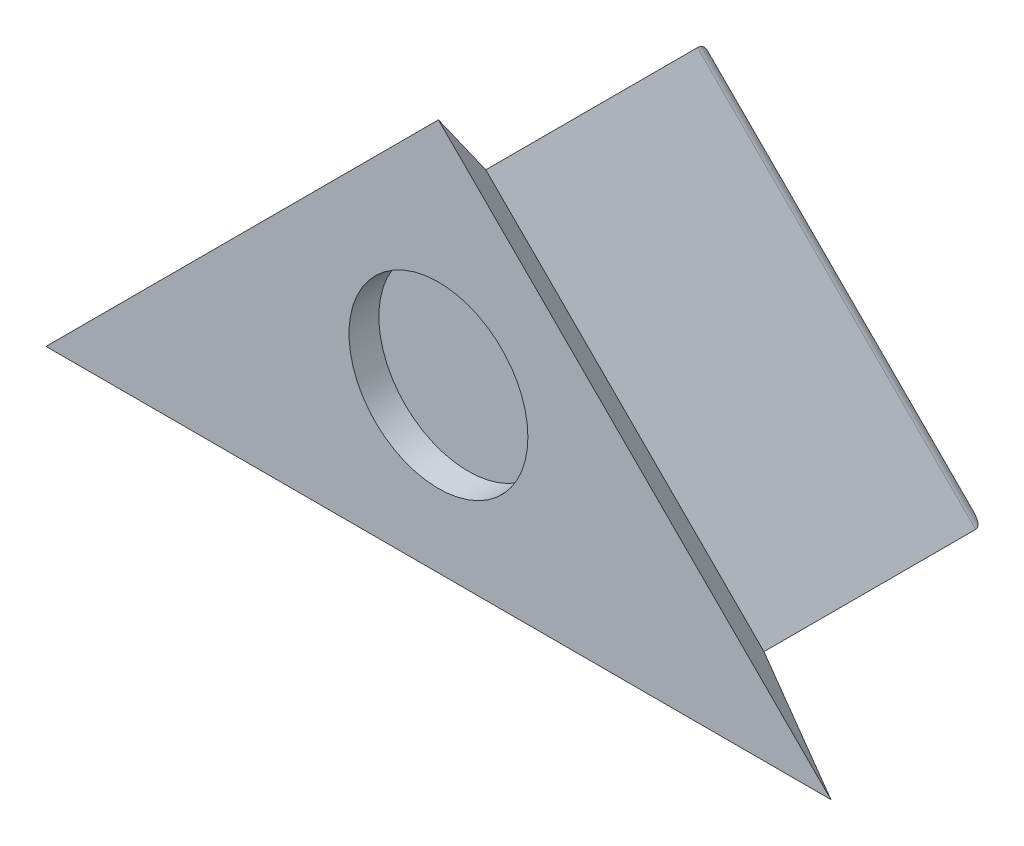
ISO-10303-21;
HEADER;
FILE_DESCRIPTION(('STEP AP214'),'2;1');
FILE_NAME('part.step','',(''),(''),'','','');
FILE_SCHEMA(('AUTOMOTIVE_DESIGN { 1 0 10303 214 1 1 1 1 }'));
ENDSEC;
DATA;
#1=APPLICATION_CONTEXT('core data for automotive mechanical design processes');
#2=APPLICATION_PROTOCOL_DEFINITION('international standard','automotive_design',2000,#1);
#3=PRODUCT_CONTEXT('',#1,'mechanical');
#4=PRODUCT('Part','Part','',(#3));
#5=PRODUCT_RELATED_PRODUCT_CATEGORY('part','',(#4));
#6=PRODUCT_DEFINITION_FORMATION('','',#4);
#7=PRODUCT_DEFINITION_CONTEXT('part definition',#1,'design');
#8=PRODUCT_DEFINITION('design','',#6,#7);
#9=PRODUCT_DEFINITION_SHAPE('','',#8);
#10=(LENGTH_UNIT() NAMED_UNIT(*) SI_UNIT(.MILLI.,.METRE.));
#11=(NAMED_UNIT(*) PLANE_ANGLE_UNIT() SI_UNIT($,.RADIAN.));
#12=(NAMED_UNIT(*) SI_UNIT($,.STERADIAN.) SOLID_ANGLE_UNIT());
#13=UNCERTAINTY_MEASURE_WITH_UNIT(LENGTH_MEASURE(1.E-05),#10,'distance_accuracy_value','');
#14=(GEOMETRIC_REPRESENTATION_CONTEXT(3) GLOBAL_UNCERTAINTY_ASSIGNED_CONTEXT((#13)) GLOBAL_UNIT_ASSIGNED_CONTEXT((#10,
#11,#12)) REPRESENTATION_CONTEXT('',''));
#15=CARTESIAN_POINT('',(0.,0.,0.));
#16=DIRECTION('',(0.,0.,1.));
#17=DIRECTION('',(1.,0.,0.));
#18=AXIS2_PLACEMENT_3D('',#15,#16,#17);
#19=CARTESIAN_POINT('',(-9.33273130117562,-89.9715896423743,-7.5));
#20=DIRECTION('',(0.,-1.,0.));
#21=DIRECTION('',(0.,0.,-1.));
#22=AXIS2_PLACEMENT_3D('',#19,#20,#21);
#23=PLANE('',#22);
#24=DIRECTION('',(0.,0.,1.));
#25=VECTOR('',#24,1.);
#26=CARTESIAN_POINT('',(-9.33273130117562,-89.9715896423743,-7.5));
#27=LINE('',#26,#25);
#28=CARTESIAN_POINT('',(-9.33273130117562,-89.9715896423743,-7.1));
#29=VERTEX_POINT('',#28);
#30=CARTESIAN_POINT('',(-9.3327313011756,-89.9715896423743,0.));
#31=VERTEX_POINT('',#30);
#32=EDGE_CURVE('E133',#29,#31,#27,.T.);
#33=ORIENTED_EDGE('',*,*,#32,.F.);
#34=DIRECTION('',(1.,0.,0.));
#35=VECTOR('',#34,1.);
#36=CARTESIAN_POINT('',(9.33273130117571,-89.9715896423743,-7.1));
#37=LINE('',#36,#35);
#38=CARTESIAN_POINT('',(9.33273130117571,-89.9715896423743,-7.1));
#39=VERTEX_POINT('',#38);
#40=EDGE_CURVE('E12',#29,#39,#37,.T.);
#41=ORIENTED_EDGE('',*,*,#40,.T.);
#42=DIRECTION('',(0.,0.,1.));
#43=VECTOR('',#42,1.);
#44=CARTESIAN_POINT('',(9.33273130117571,-89.9715896423743,-7.5));
#45=LINE('',#44,#43);
#46=CARTESIAN_POINT('',(9.33273130117572,-89.9715896423743,0.));
#47=VERTEX_POINT('',#46);
#48=EDGE_CURVE('E237',#39,#47,#45,.T.);
#49=ORIENTED_EDGE('',*,*,#48,.T.);
#50=DIRECTION('',(1.,0.,0.));
#51=VECTOR('',#50,1.);
#52=CARTESIAN_POINT('',(0.,-89.9715896423743,0.));
#53=LINE('',#52,#51);
#54=EDGE_CURVE('E165',#31,#47,#53,.T.);
#55=ORIENTED_EDGE('',*,*,#54,.F.);
#56=EDGE_LOOP('',(#33,#41,#49,#55));
#57=FACE_BOUND('',#56,.T.);
#58=ADVANCED_FACE('F39',(#57),#23,.T.);
#59=CARTESIAN_POINT('',(1.02673945734377E-13,-80.6388583411986,-7.5));
#60=DIRECTION('',(-0.707106781186546,0.70710678118655,0.));
#61=DIRECTION('',(-0.70710678118655,-0.707106781186546,0.));
#62=AXIS2_PLACEMENT_3D('',#59,#60,#61);
#63=PLANE('',#62);
#64=DIRECTION('',(0.,0.,1.));
#65=VECTOR('',#64,1.);
#66=CARTESIAN_POINT('',(1.02673945734377E-13,-80.6388583411986,-7.5));
#67=LINE('',#66,#65);
#68=CARTESIAN_POINT('',(1.02673945734377E-13,-80.6388583411986,-7.1));
#69=VERTEX_POINT('',#68);
#70=CARTESIAN_POINT('',(1.05873863456701E-13,-80.6388583411986,0.));
#71=VERTEX_POINT('',#70);
#72=EDGE_CURVE('E239',#69,#71,#67,.T.);
#73=ORIENTED_EDGE('',*,*,#72,.F.);
#74=DIRECTION('',(-0.70710678118655,-0.707106781186546,0.));
#75=VECTOR('',#74,1.);
#76=CARTESIAN_POINT('',(-9.33273130117562,-89.9715896423743,-7.1));
#77=LINE('',#76,#75);
#78=EDGE_CURVE('E48',#69,#29,#77,.T.);
#79=ORIENTED_EDGE('',*,*,#78,.T.);
#80=ORIENTED_EDGE('',*,*,#32,.T.);
#81=DIRECTION('',(-0.707106781186548,-0.707106781186546,0.));
#82=VECTOR('',#81,1.);
#83=CARTESIAN_POINT('',(1.04083408558608E-13,-80.6388583411986,0.));
#84=LINE('',#83,#82);
#85=EDGE_CURVE('E119',#71,#31,#84,.T.);
#86=ORIENTED_EDGE('',*,*,#85,.F.);
#87=EDGE_LOOP('',(#73,#79,#80,#86));
#88=FACE_BOUND('',#87,.T.);
#89=ADVANCED_FACE('F243',(#88),#63,.T.);
#90=CARTESIAN_POINT('',(9.33273130117571,-89.9715896423743,-7.5));
#91=DIRECTION('',(0.70710678118655,0.707106781186545,0.));
#92=DIRECTION('',(-0.707106781186545,0.70710678118655,0.));
#93=AXIS2_PLACEMENT_3D('',#90,#91,#92);
#94=PLANE('',#93);
#95=ORIENTED_EDGE('',*,*,#48,.F.);
#96=DIRECTION('',(-0.707106781186545,0.70710678118655,0.));
#97=VECTOR('',#96,1.);
#98=CARTESIAN_POINT('',(0.,-80.6388583411986,-7.1));
#99=LINE('',#98,#97);
#100=EDGE_CURVE('E230',#39,#69,#99,.T.);
#101=ORIENTED_EDGE('',*,*,#100,.T.);
#102=ORIENTED_EDGE('',*,*,#72,.T.);
#103=DIRECTION('',(-0.707106781186545,0.70710678118655,0.));
#104=VECTOR('',#103,1.);
#105=CARTESIAN_POINT('',(9.3327313011757,-89.9715896423743,0.));
#106=LINE('',#105,#104);
#107=EDGE_CURVE('E233',#47,#71,#106,.T.);
#108=ORIENTED_EDGE('',*,*,#107,.F.);
#109=EDGE_LOOP('',(#95,#101,#102,#108));
#110=FACE_BOUND('',#109,.T.);
#111=ADVANCED_FACE('F247',(#110),#94,.T.);
#112=CARTESIAN_POINT('',(0.,0.,-7.5));
#113=DIRECTION('',(0.,0.,1.));
#114=DIRECTION('',(1.,0.,0.));
#115=AXIS2_PLACEMENT_3D('',#112,#113,#114);
#116=PLANE('',#115);
#117=DIRECTION('',(-0.70710678118655,-0.707106781186546,0.));
#118=VECTOR('',#117,1.);
#119=CARTESIAN_POINT('',(0.282842712474724,-80.9217010536732,-7.5));
#120=LINE('',#119,#118);
#121=CARTESIAN_POINT('',(-8.36704587622637,-89.5715896423743,-7.5));
#122=VERTEX_POINT('',#121);
#123=CARTESIAN_POINT('',(1.08742628073339E-13,-81.2045437661479,-7.5));
#124=VERTEX_POINT('',#123);
#125=EDGE_CURVE('E63',#122,#124,#120,.F.);
#126=ORIENTED_EDGE('',*,*,#125,.T.);
#127=DIRECTION('',(-0.707106781186545,0.70710678118655,0.));
#128=VECTOR('',#127,1.);
#129=CARTESIAN_POINT('',(9.04988858870109,-90.2544323548489,-7.5));
#130=LINE('',#129,#128);
#131=CARTESIAN_POINT('',(8.36704587622648,-89.5715896423743,-7.5));
#132=VERTEX_POINT('',#131);
#133=EDGE_CURVE('E225',#124,#132,#130,.F.);
#134=ORIENTED_EDGE('',*,*,#133,.T.);
#135=DIRECTION('',(1.,0.,0.));
#136=VECTOR('',#135,1.);
#137=CARTESIAN_POINT('',(-9.33273130117562,-89.5715896423743,-7.5));
#138=LINE('',#137,#136);
#139=EDGE_CURVE('E228',#132,#122,#138,.F.);
#140=ORIENTED_EDGE('',*,*,#139,.T.);
#141=EDGE_LOOP('',(#126,#134,#140));
#142=FACE_BOUND('',#141,.T.);
#143=ADVANCED_FACE('F144',(#142),#116,.F.);
#144=CARTESIAN_POINT('',(0.,0.,1.5875));
#145=DIRECTION('',(0.,0.,-1.));
#146=DIRECTION('',(-1.,0.,0.));
#147=AXIS2_PLACEMENT_3D('',#144,#145,#146);
#148=PLANE('',#147);
#149=CARTESIAN_POINT('',(0.,-86.1058457634434,1.5875));
#150=DIRECTION('',(0.,0.,1.));
#151=DIRECTION('',(1.,0.,0.));
#152=AXIS2_PLACEMENT_3D('',#149,#150,#151);
#153=CIRCLE('',#152,3.);
#154=CARTESIAN_POINT('',(3.,-86.1058457634434,1.5875));
#155=VERTEX_POINT('',#154);
#156=EDGE_CURVE('E210',#155,#155,#153,.T.);
#157=ORIENTED_EDGE('',*,*,#156,.F.);
#158=EDGE_LOOP('',(#157));
#159=FACE_BOUND('',#158,.T.);
#160=DIRECTION('',(-0.707106781186549,-0.707106781186546,0.));
#161=VECTOR('',#160,1.);
#162=CARTESIAN_POINT('',(1.06251812903579E-13,-78.3937943109313,1.5875));
#163=LINE('',#162,#161);
#164=CARTESIAN_POINT('',(1.06251812903579E-13,-78.3937943109313,1.5875));
#165=VERTEX_POINT('',#164);
#166=CARTESIAN_POINT('',(-13.1652953314429,-91.5590896423743,1.5875));
#167=VERTEX_POINT('',#166);
#168=EDGE_CURVE('E108',#165,#167,#163,.T.);
#169=ORIENTED_EDGE('',*,*,#168,.T.);
#170=DIRECTION('',(1.,0.,0.));
#171=VECTOR('',#170,1.);
#172=CARTESIAN_POINT('',(-13.1652953314429,-91.5590896423743,1.5875));
#173=LINE('',#172,#171);
#174=CARTESIAN_POINT('',(13.165295331443,-91.5590896423743,1.5875));
#175=VERTEX_POINT('',#174);
#176=EDGE_CURVE('E94',#167,#175,#173,.T.);
#177=ORIENTED_EDGE('',*,*,#176,.T.);
#178=DIRECTION('',(-0.707106781186545,0.70710678118655,0.));
#179=VECTOR('',#178,1.);
#180=CARTESIAN_POINT('',(13.165295331443,-91.5590896423743,1.5875));
#181=LINE('',#180,#179);
#182=EDGE_CURVE('E107',#175,#165,#181,.T.);
#183=ORIENTED_EDGE('',*,*,#182,.T.);
#184=EDGE_LOOP('',(#169,#177,#183));
#185=FACE_BOUND('',#184,.T.);
#186=ADVANCED_FACE('F123',(#159,#185),#148,.F.);
#187=CARTESIAN_POINT('',(0.,-44.985794821187,-44.9857948211871));
#188=DIRECTION('',(0.,-0.707106781186546,-0.707106781186549));
#189=DIRECTION('',(0.,0.707106781186549,-0.707106781186546));
#190=AXIS2_PLACEMENT_3D('',#187,#188,#189);
#191=PLANE('',#190);
#192=DIRECTION('',(0.862856209461016,-0.357406744336595,0.357406744336594));
#193=VECTOR('',#192,1.);
#194=CARTESIAN_POINT('',(9.33273130117571,-89.9715896423743,0.));
#195=LINE('',#194,#193);
#196=EDGE_CURVE('E102',#47,#175,#195,.T.);
#197=ORIENTED_EDGE('',*,*,#196,.T.);
#198=ORIENTED_EDGE('',*,*,#176,.F.);
#199=DIRECTION('',(-0.862856209461018,-0.357406744336593,0.357406744336591));
#200=VECTOR('',#199,1.);
#201=CARTESIAN_POINT('',(-9.33273130117562,-89.9715896423743,0.));
#202=LINE('',#201,#200);
#203=EDGE_CURVE('E99',#31,#167,#202,.T.);
#204=ORIENTED_EDGE('',*,*,#203,.F.);
#205=ORIENTED_EDGE('',*,*,#54,.T.);
#206=EDGE_LOOP('',(#197,#198,#204,#205));
#207=FACE_BOUND('',#206,.T.);
#208=ADVANCED_FACE('F97',(#207),#191,.T.);
#209=CARTESIAN_POINT('',(20.1597145852996,-20.1597145852997,28.5101417801016));
#210=DIRECTION('',(-0.499999999999998,0.5,-0.707106781186549));
#211=DIRECTION('',(0.,0.816496580927726,0.577350269189626));
#212=AXIS2_PLACEMENT_3D('',#209,#210,#211);
#213=PLANE('',#212);
#214=ORIENTED_EDGE('',*,*,#203,.T.);
#215=ORIENTED_EDGE('',*,*,#168,.F.);
#216=DIRECTION('',(0.,0.816496580927727,0.577350269189625));
#217=VECTOR('',#216,1.);
#218=CARTESIAN_POINT('',(1.02673945734377E-13,-80.6388583411986,0.));
#219=LINE('',#218,#217);
#220=EDGE_CURVE('E120',#71,#165,#219,.T.);
#221=ORIENTED_EDGE('',*,*,#220,.F.);
#222=ORIENTED_EDGE('',*,*,#85,.T.);
#223=EDGE_LOOP('',(#214,#215,#221,#222));
#224=FACE_BOUND('',#223,.T.);
#225=ADVANCED_FACE('F114',(#224),#213,.T.);
#226=CARTESIAN_POINT('',(-20.1597145852996,-20.1597145852995,28.5101417801013));
#227=DIRECTION('',(0.500000000000002,0.499999999999998,-0.707106781186548));
#228=DIRECTION('',(-0.816496580927725,0.,-0.577350269189627));
#229=AXIS2_PLACEMENT_3D('',#226,#227,#228);
#230=PLANE('',#229);
#231=ORIENTED_EDGE('',*,*,#220,.T.);
#232=ORIENTED_EDGE('',*,*,#182,.F.);
#233=ORIENTED_EDGE('',*,*,#196,.F.);
#234=ORIENTED_EDGE('',*,*,#107,.T.);
#235=EDGE_LOOP('',(#231,#232,#233,#234));
#236=FACE_BOUND('',#235,.T.);
#237=ADVANCED_FACE('F146',(#236),#230,.T.);
#238=CARTESIAN_POINT('',(-9.33273130117562,-89.5715896423743,-7.1));
#239=DIRECTION('',(-1.,0.,0.));
#240=DIRECTION('',(0.,0.,1.));
#241=AXIS2_PLACEMENT_3D('',#238,#239,#240);
#242=CYLINDRICAL_SURFACE('',#241,0.4);
#243=CARTESIAN_POINT('',(8.36704587622648,-89.5715896423743,-7.1));
#244=DIRECTION('',(-0.382683432365091,-0.923879532511286,0.));
#245=DIRECTION('',(-0.923879532511286,0.382683432365091,0.));
#246=AXIS2_PLACEMENT_3D('',#243,#244,#245);
#247=ELLIPSE('',#246,1.0452503719011,0.4);
#248=EDGE_CURVE('E218',#39,#132,#247,.F.);
#249=ORIENTED_EDGE('',*,*,#248,.F.);
#250=ORIENTED_EDGE('',*,*,#40,.F.);
#251=CARTESIAN_POINT('',(-8.36704587622637,-89.5715896423743,-7.1));
#252=DIRECTION('',(-0.382683432365088,0.923879532511287,0.));
#253=DIRECTION('',(-0.923879532511287,-0.382683432365088,0.));
#254=AXIS2_PLACEMENT_3D('',#251,#252,#253);
#255=ELLIPSE('',#254,1.0452503719011,0.4);
#256=EDGE_CURVE('E43',#122,#29,#255,.T.);
#257=ORIENTED_EDGE('',*,*,#256,.F.);
#258=ORIENTED_EDGE('',*,*,#139,.F.);
#259=EDGE_LOOP('',(#249,#250,#257,#258));
#260=FACE_BOUND('',#259,.T.);
#261=ADVANCED_FACE('F41',(#260),#242,.T.);
#262=CARTESIAN_POINT('',(0.282842712474721,-80.9217010536732,-7.1));
#263=DIRECTION('',(0.70710678118655,0.707106781186546,0.));
#264=DIRECTION('',(-0.707106781186546,0.70710678118655,0.));
#265=AXIS2_PLACEMENT_3D('',#262,#263,#264);
#266=CYLINDRICAL_SURFACE('',#265,0.4);
#267=ORIENTED_EDGE('',*,*,#256,.T.);
#268=ORIENTED_EDGE('',*,*,#78,.F.);
#269=CARTESIAN_POINT('',(1.04950770296597E-13,-81.2045437661479,-7.1));
#270=DIRECTION('',(1.,0.,0.));
#271=DIRECTION('',(0.,1.,0.));
#272=AXIS2_PLACEMENT_3D('',#269,#270,#271);
#273=ELLIPSE('',#272,0.565685424949238,0.4);
#274=EDGE_CURVE('E215',#124,#69,#273,.T.);
#275=ORIENTED_EDGE('',*,*,#274,.F.);
#276=ORIENTED_EDGE('',*,*,#125,.F.);
#277=EDGE_LOOP('',(#267,#268,#275,#276));
#278=FACE_BOUND('',#277,.T.);
#279=ADVANCED_FACE('F255',(#278),#266,.T.);
#280=CARTESIAN_POINT('',(9.04988858870109,-90.2544323548489,-7.1));
#281=DIRECTION('',(0.707106781186545,-0.70710678118655,0.));
#282=DIRECTION('',(0.70710678118655,0.707106781186545,0.));
#283=AXIS2_PLACEMENT_3D('',#280,#281,#282);
#284=CYLINDRICAL_SURFACE('',#283,0.4);
#285=ORIENTED_EDGE('',*,*,#248,.T.);
#286=ORIENTED_EDGE('',*,*,#133,.F.);
#287=ORIENTED_EDGE('',*,*,#274,.T.);
#288=ORIENTED_EDGE('',*,*,#100,.F.);
#289=EDGE_LOOP('',(#285,#286,#287,#288));
#290=FACE_BOUND('',#289,.T.);
#291=ADVANCED_FACE('F253',(#290),#284,.T.);
#292=CARTESIAN_POINT('',(0.,-86.1058457634434,0.5875));
#293=DIRECTION('',(0.,0.,1.));
#294=DIRECTION('',(1.,0.,0.));
#295=AXIS2_PLACEMENT_3D('',#292,#293,#294);
#296=CYLINDRICAL_SURFACE('',#295,3.);
#297=CARTESIAN_POINT('',(0.,-86.1058457634434,0.5875));
#298=DIRECTION('',(0.,0.,1.));
#299=DIRECTION('',(1.,0.,0.));
#300=AXIS2_PLACEMENT_3D('',#297,#298,#299);
#301=CIRCLE('',#300,3.);
#302=CARTESIAN_POINT('',(3.,-86.1058457634434,0.5875));
#303=VERTEX_POINT('',#302);
#304=EDGE_CURVE('E213',#303,#303,#301,.T.);
#305=ORIENTED_EDGE('',*,*,#304,.F.);
#306=EDGE_LOOP('',(#305));
#307=FACE_BOUND('',#306,.T.);
#308=ORIENTED_EDGE('',*,*,#156,.T.);
#309=EDGE_LOOP('',(#308));
#310=FACE_BOUND('',#309,.T.);
#311=ADVANCED_FACE('F180',(#307,#310),#296,.F.);
#312=CARTESIAN_POINT('',(0.,-86.1058457634434,0.5875));
#313=DIRECTION('',(0.,0.,1.));
#314=DIRECTION('',(1.,0.,0.));
#315=AXIS2_PLACEMENT_3D('',#312,#313,#314);
#316=PLANE('',#315);
#317=ORIENTED_EDGE('',*,*,#304,.T.);
#318=EDGE_LOOP('',(#317));
#319=FACE_BOUND('',#318,.T.);
#320=ADVANCED_FACE('F261',(#319),#316,.T.);
#321=CLOSED_SHELL('',(#58,#89,#111,#143,#186,#208,#225,#237,#261,#279,#291,#311,#320));
#322=MANIFOLD_SOLID_BREP('B2',#321);
#323=ADVANCED_BREP_SHAPE_REPRESENTATION('',(#18,#322),#14);
#324=SHAPE_DEFINITION_REPRESENTATION(#9,#323);
ENDSEC;
END-ISO-10303-21;
